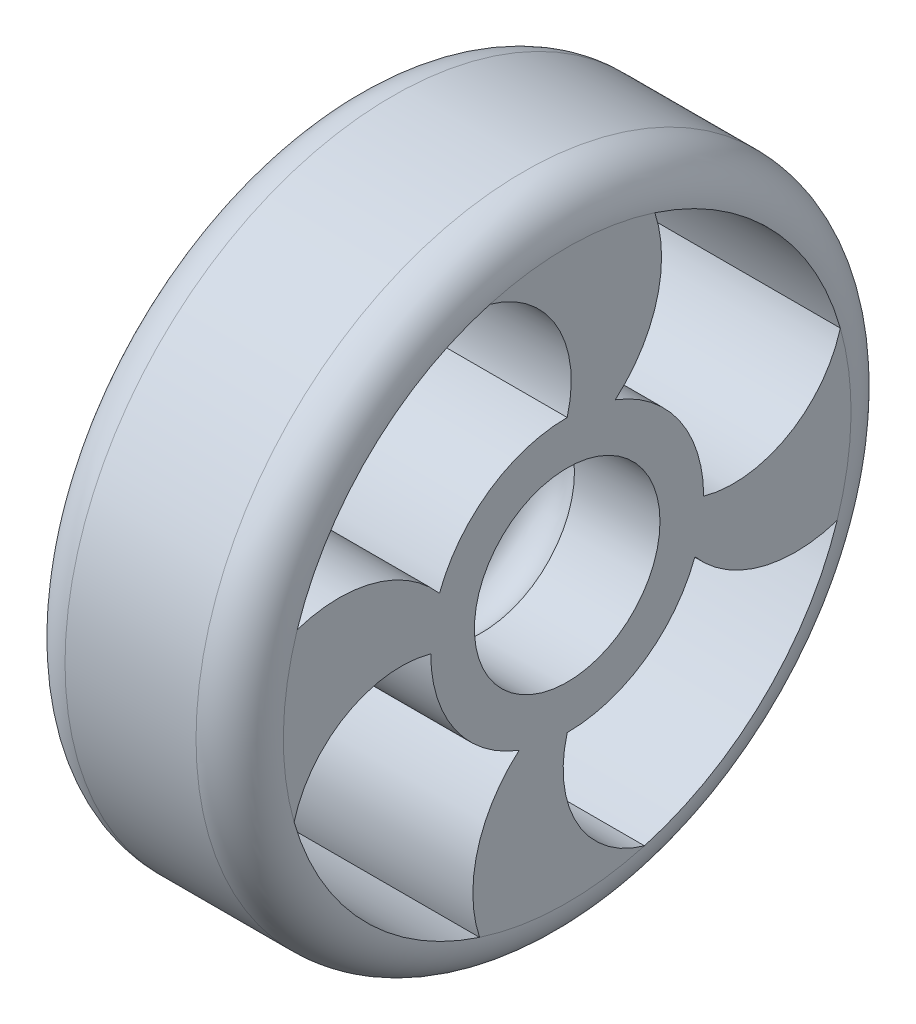
ISO-10303-21;
HEADER;
FILE_DESCRIPTION(('STEP AP214'),'2;1');
FILE_NAME('part.step','',(''),(''),'','','');
FILE_SCHEMA(('AUTOMOTIVE_DESIGN { 1 0 10303 214 1 1 1 1 }'));
ENDSEC;
DATA;
#1=APPLICATION_CONTEXT('core data for automotive mechanical design processes');
#2=APPLICATION_PROTOCOL_DEFINITION('international standard','automotive_design',2000,#1);
#3=PRODUCT_CONTEXT('',#1,'mechanical');
#4=PRODUCT('Part','Part','',(#3));
#5=PRODUCT_RELATED_PRODUCT_CATEGORY('part','',(#4));
#6=PRODUCT_DEFINITION_FORMATION('','',#4);
#7=PRODUCT_DEFINITION_CONTEXT('part definition',#1,'design');
#8=PRODUCT_DEFINITION('design','',#6,#7);
#9=PRODUCT_DEFINITION_SHAPE('','',#8);
#10=(LENGTH_UNIT() NAMED_UNIT(*) SI_UNIT(.MILLI.,.METRE.));
#11=(NAMED_UNIT(*) PLANE_ANGLE_UNIT() SI_UNIT($,.RADIAN.));
#12=(NAMED_UNIT(*) SI_UNIT($,.STERADIAN.) SOLID_ANGLE_UNIT());
#13=UNCERTAINTY_MEASURE_WITH_UNIT(LENGTH_MEASURE(1.E-05),#10,'distance_accuracy_value','');
#14=(GEOMETRIC_REPRESENTATION_CONTEXT(3) GLOBAL_UNCERTAINTY_ASSIGNED_CONTEXT((#13)) GLOBAL_UNIT_ASSIGNED_CONTEXT((#10,
#11,#12)) REPRESENTATION_CONTEXT('',''));
#15=CARTESIAN_POINT('',(0.,0.,0.));
#16=DIRECTION('',(0.,0.,1.));
#17=DIRECTION('',(1.,0.,0.));
#18=AXIS2_PLACEMENT_3D('',#15,#16,#17);
#19=CARTESIAN_POINT('',(25.4,0.,0.));
#20=DIRECTION('',(-1.,0.,0.));
#21=DIRECTION('',(0.,0.,1.));
#22=AXIS2_PLACEMENT_3D('',#19,#20,#21);
#23=CYLINDRICAL_SURFACE('',#22,10.795);
#24=CARTESIAN_POINT('',(0.,0.,0.));
#25=DIRECTION('',(1.,0.,0.));
#26=DIRECTION('',(0.,0.,-1.));
#27=AXIS2_PLACEMENT_3D('',#24,#25,#26);
#28=CIRCLE('',#27,10.795);
#29=CARTESIAN_POINT('',(0.,0.,-10.795));
#30=VERTEX_POINT('',#29);
#31=EDGE_CURVE('E245',#30,#30,#28,.T.);
#32=ORIENTED_EDGE('',*,*,#31,.F.);
#33=EDGE_LOOP('',(#32));
#34=FACE_BOUND('',#33,.T.);
#35=CARTESIAN_POINT('',(9.95036934298441,0.,0.));
#36=DIRECTION('',(1.,0.,0.));
#37=DIRECTION('',(0.,0.,-1.));
#38=AXIS2_PLACEMENT_3D('',#35,#36,#37);
#39=CIRCLE('',#38,10.795);
#40=CARTESIAN_POINT('',(9.95036934298441,0.,-10.795));
#41=VERTEX_POINT('',#40);
#42=CARTESIAN_POINT('',(9.95036934298441,10.795,0.));
#43=VERTEX_POINT('',#42);
#44=EDGE_CURVE('E169',#41,#43,#39,.T.);
#45=ORIENTED_EDGE('',*,*,#44,.T.);
#46=CARTESIAN_POINT('',(9.95036934298441,0.,0.));
#47=DIRECTION('',(1.,0.,0.));
#48=DIRECTION('',(0.,0.,-1.));
#49=AXIS2_PLACEMENT_3D('',#46,#47,#48);
#50=CIRCLE('',#49,10.795);
#51=EDGE_CURVE('E165',#43,#41,#50,.T.);
#52=ORIENTED_EDGE('',*,*,#51,.T.);
#53=EDGE_LOOP('',(#45,#52));
#54=FACE_BOUND('',#53,.T.);
#55=ADVANCED_FACE('F34',(#34,#54),#23,.F.);
#56=CARTESIAN_POINT('',(25.4,0.,0.));
#57=DIRECTION('',(1.,0.,0.));
#58=DIRECTION('',(0.,0.,-1.));
#59=AXIS2_PLACEMENT_3D('',#56,#57,#58);
#60=CIRCLE('',#59,10.795);
#61=CARTESIAN_POINT('',(25.4,0.,-10.795));
#62=VERTEX_POINT('',#61);
#63=EDGE_CURVE('E280',#62,#62,#60,.T.);
#64=ORIENTED_EDGE('',*,*,#63,.T.);
#65=EDGE_LOOP('',(#64));
#66=FACE_BOUND('',#65,.T.);
#67=CARTESIAN_POINT('',(15.4496306570156,0.,0.));
#68=DIRECTION('',(-1.,0.,0.));
#69=DIRECTION('',(0.,0.,1.));
#70=AXIS2_PLACEMENT_3D('',#67,#68,#69);
#71=CIRCLE('',#70,10.795);
#72=CARTESIAN_POINT('',(15.4496306570156,10.795,0.));
#73=VERTEX_POINT('',#72);
#74=CARTESIAN_POINT('',(15.4496306570156,0.,-10.795));
#75=VERTEX_POINT('',#74);
#76=EDGE_CURVE('E155',#73,#75,#71,.T.);
#77=ORIENTED_EDGE('',*,*,#76,.T.);
#78=CARTESIAN_POINT('',(15.4496306570156,0.,0.));
#79=DIRECTION('',(-1.,0.,0.));
#80=DIRECTION('',(0.,0.,1.));
#81=AXIS2_PLACEMENT_3D('',#78,#79,#80);
#82=CIRCLE('',#81,10.795);
#83=EDGE_CURVE('E159',#75,#73,#82,.T.);
#84=ORIENTED_EDGE('',*,*,#83,.T.);
#85=EDGE_LOOP('',(#77,#84));
#86=FACE_BOUND('',#85,.T.);
#87=ADVANCED_FACE('F168',(#66,#86),#23,.F.);
#88=CARTESIAN_POINT('',(25.4,0.,0.));
#89=DIRECTION('',(-1.,0.,0.));
#90=DIRECTION('',(0.,0.,1.));
#91=AXIS2_PLACEMENT_3D('',#88,#89,#90);
#92=CYLINDRICAL_SURFACE('',#91,15.875);
#93=DIRECTION('',(-1.,0.,0.));
#94=VECTOR('',#93,1.);
#95=CARTESIAN_POINT('',(25.4,0.,15.875));
#96=LINE('',#95,#94);
#97=CARTESIAN_POINT('',(25.4,0.,15.875));
#98=VERTEX_POINT('',#97);
#99=CARTESIAN_POINT('',(0.,0.,15.875));
#100=VERTEX_POINT('',#99);
#101=EDGE_CURVE('E277',#98,#100,#96,.T.);
#102=ORIENTED_EDGE('',*,*,#101,.T.);
#103=CARTESIAN_POINT('',(0.,0.,0.));
#104=DIRECTION('',(1.,0.,0.));
#105=DIRECTION('',(0.,0.,-1.));
#106=AXIS2_PLACEMENT_3D('',#103,#104,#105);
#107=CIRCLE('',#106,15.875);
#108=CARTESIAN_POINT('',(0.,-14.8592954657367,5.58721426669291));
#109=VERTEX_POINT('',#108);
#110=EDGE_CURVE('E294',#100,#109,#107,.T.);
#111=ORIENTED_EDGE('',*,*,#110,.T.);
#112=DIRECTION('',(-1.,0.,0.));
#113=VECTOR('',#112,1.);
#114=CARTESIAN_POINT('',(25.4,-14.8592954657367,5.5872142666929));
#115=LINE('',#114,#113);
#116=CARTESIAN_POINT('',(25.4,-14.8592954657367,5.58721426669291));
#117=VERTEX_POINT('',#116);
#118=EDGE_CURVE('E249',#117,#109,#115,.T.);
#119=ORIENTED_EDGE('',*,*,#118,.F.);
#120=CARTESIAN_POINT('',(25.4,0.,0.));
#121=DIRECTION('',(1.,0.,0.));
#122=DIRECTION('',(0.,0.,-1.));
#123=AXIS2_PLACEMENT_3D('',#120,#121,#122);
#124=CIRCLE('',#123,15.875);
#125=EDGE_CURVE('E293',#98,#117,#124,.T.);
#126=ORIENTED_EDGE('',*,*,#125,.F.);
#127=EDGE_LOOP('',(#102,#111,#119,#126));
#128=FACE_BOUND('',#127,.T.);
#129=ADVANCED_FACE('F298',(#128),#92,.T.);
#130=DIRECTION('',(-1.,0.,0.));
#131=VECTOR('',#130,1.);
#132=CARTESIAN_POINT('',(25.4,-15.875,0.));
#133=LINE('',#132,#131);
#134=CARTESIAN_POINT('',(25.4,-15.875,0.));
#135=VERTEX_POINT('',#134);
#136=CARTESIAN_POINT('',(0.,-15.875,0.));
#137=VERTEX_POINT('',#136);
#138=EDGE_CURVE('E252',#135,#137,#133,.T.);
#139=ORIENTED_EDGE('',*,*,#138,.T.);
#140=CARTESIAN_POINT('',(0.,-5.58721426669286,-14.8592954657367));
#141=VERTEX_POINT('',#140);
#142=EDGE_CURVE('E283',#137,#141,#107,.T.);
#143=ORIENTED_EDGE('',*,*,#142,.T.);
#144=DIRECTION('',(-1.,0.,0.));
#145=VECTOR('',#144,1.);
#146=CARTESIAN_POINT('',(25.4,-5.58721426669285,-14.8592954657367));
#147=LINE('',#146,#145);
#148=CARTESIAN_POINT('',(25.4,-5.58721426669286,-14.8592954657367));
#149=VERTEX_POINT('',#148);
#150=EDGE_CURVE('E223',#149,#141,#147,.T.);
#151=ORIENTED_EDGE('',*,*,#150,.F.);
#152=EDGE_CURVE('E288',#135,#149,#124,.T.);
#153=ORIENTED_EDGE('',*,*,#152,.F.);
#154=EDGE_LOOP('',(#139,#143,#151,#153));
#155=FACE_BOUND('',#154,.T.);
#156=ADVANCED_FACE('F400',(#155),#92,.T.);
#157=DIRECTION('',(-1.,0.,0.));
#158=VECTOR('',#157,1.);
#159=CARTESIAN_POINT('',(25.4,1.12757025938492E-13,-15.875));
#160=LINE('',#159,#158);
#161=CARTESIAN_POINT('',(25.4,1.12757025938492E-13,-15.875));
#162=VERTEX_POINT('',#161);
#163=CARTESIAN_POINT('',(0.,0.,-15.875));
#164=VERTEX_POINT('',#163);
#165=EDGE_CURVE('E256',#162,#164,#160,.T.);
#166=ORIENTED_EDGE('',*,*,#165,.T.);
#167=CARTESIAN_POINT('',(0.,14.8592954657367,-5.58721426669281));
#168=VERTEX_POINT('',#167);
#169=EDGE_CURVE('E289',#164,#168,#107,.T.);
#170=ORIENTED_EDGE('',*,*,#169,.T.);
#171=DIRECTION('',(-1.,0.,0.));
#172=VECTOR('',#171,1.);
#173=CARTESIAN_POINT('',(25.4,14.8592954657367,-5.58721426669281));
#174=LINE('',#173,#172);
#175=CARTESIAN_POINT('',(25.4,14.8592954657367,-5.58721426669281));
#176=VERTEX_POINT('',#175);
#177=EDGE_CURVE('E263',#176,#168,#174,.T.);
#178=ORIENTED_EDGE('',*,*,#177,.F.);
#179=EDGE_CURVE('E160',#162,#176,#124,.T.);
#180=ORIENTED_EDGE('',*,*,#179,.F.);
#181=EDGE_LOOP('',(#166,#170,#178,#180));
#182=FACE_BOUND('',#181,.T.);
#183=ADVANCED_FACE('F580',(#182),#92,.T.);
#184=DIRECTION('',(-1.,0.,0.));
#185=VECTOR('',#184,1.);
#186=CARTESIAN_POINT('',(25.4,15.875,1.6826817716975E-13));
#187=LINE('',#186,#185);
#188=CARTESIAN_POINT('',(25.4,15.875,1.6826817716975E-13));
#189=VERTEX_POINT('',#188);
#190=CARTESIAN_POINT('',(0.,15.875,1.66645094246512E-13));
#191=VERTEX_POINT('',#190);
#192=EDGE_CURVE('E266',#189,#191,#187,.T.);
#193=ORIENTED_EDGE('',*,*,#192,.T.);
#194=CARTESIAN_POINT('',(0.,5.58721426669296,14.8592954657367));
#195=VERTEX_POINT('',#194);
#196=EDGE_CURVE('E290',#191,#195,#107,.T.);
#197=ORIENTED_EDGE('',*,*,#196,.T.);
#198=DIRECTION('',(-1.,0.,0.));
#199=VECTOR('',#198,1.);
#200=CARTESIAN_POINT('',(25.4,5.58721426669296,14.8592954657367));
#201=LINE('',#200,#199);
#202=CARTESIAN_POINT('',(25.4,5.58721426669296,14.8592954657367));
#203=VERTEX_POINT('',#202);
#204=EDGE_CURVE('E274',#203,#195,#201,.T.);
#205=ORIENTED_EDGE('',*,*,#204,.F.);
#206=EDGE_CURVE('E287',#189,#203,#124,.T.);
#207=ORIENTED_EDGE('',*,*,#206,.F.);
#208=EDGE_LOOP('',(#193,#197,#205,#207));
#209=FACE_BOUND('',#208,.T.);
#210=ADVANCED_FACE('F373',(#209),#92,.T.);
#211=CARTESIAN_POINT('',(25.4,0.,0.));
#212=DIRECTION('',(1.,0.,0.));
#213=DIRECTION('',(0.,0.,-1.));
#214=AXIS2_PLACEMENT_3D('',#211,#212,#213);
#215=PLANE('',#214);
#216=CARTESIAN_POINT('',(25.4,-26.5615105564731,-4.42340725616082));
#217=DIRECTION('',(1.,0.,0.));
#218=DIRECTION('',(0.,0.,-1.));
#219=AXIS2_PLACEMENT_3D('',#216,#217,#218);
#220=CIRCLE('',#219,15.3998175737143);
#221=CARTESIAN_POINT('',(25.4,-31.4069682527934,10.1942505937429));
#222=VERTEX_POINT('',#221);
#223=EDGE_CURVE('E309',#117,#222,#220,.T.);
#224=ORIENTED_EDGE('',*,*,#223,.T.);
#225=CARTESIAN_POINT('',(25.4,0.,0.));
#226=DIRECTION('',(1.,0.,0.));
#227=DIRECTION('',(0.,0.,-1.));
#228=AXIS2_PLACEMENT_3D('',#225,#226,#227);
#229=CIRCLE('',#228,33.02);
#230=CARTESIAN_POINT('',(25.4,-31.7723162186838,-8.99112462931971));
#231=VERTEX_POINT('',#230);
#232=EDGE_CURVE('E187',#222,#231,#229,.T.);
#233=ORIENTED_EDGE('',*,*,#232,.T.);
#234=CARTESIAN_POINT('',(25.4,-19.3280957946821,-12.4442204240018));
#235=DIRECTION('',(-1.,0.,0.));
#236=DIRECTION('',(0.,0.,-1.));
#237=AXIS2_PLACEMENT_3D('',#234,#235,#236);
#238=CIRCLE('',#237,12.9144296245864);
#239=EDGE_CURVE('E324',#231,#135,#238,.T.);
#240=ORIENTED_EDGE('',*,*,#239,.T.);
#241=ORIENTED_EDGE('',*,*,#152,.T.);
#242=CARTESIAN_POINT('',(25.4,4.42340725616091,-26.5615105564731));
#243=DIRECTION('',(1.,0.,0.));
#244=DIRECTION('',(0.,0.,-1.));
#245=AXIS2_PLACEMENT_3D('',#242,#243,#244);
#246=CIRCLE('',#245,15.3998175737143);
#247=CARTESIAN_POINT('',(25.4,-10.1942505937427,-31.4069682527935));
#248=VERTEX_POINT('',#247);
#249=EDGE_CURVE('E393',#149,#248,#246,.T.);
#250=ORIENTED_EDGE('',*,*,#249,.T.);
#251=CARTESIAN_POINT('',(25.4,0.,0.));
#252=DIRECTION('',(1.,0.,0.));
#253=DIRECTION('',(0.,0.,-1.));
#254=AXIS2_PLACEMENT_3D('',#251,#252,#253);
#255=CIRCLE('',#254,33.02);
#256=CARTESIAN_POINT('',(25.4,8.9911246293198,-31.7723162186838));
#257=VERTEX_POINT('',#256);
#258=EDGE_CURVE('E185',#248,#257,#255,.T.);
#259=ORIENTED_EDGE('',*,*,#258,.T.);
#260=CARTESIAN_POINT('',(25.4,12.4442204240019,-19.3280957946821));
#261=DIRECTION('',(-1.,0.,0.));
#262=DIRECTION('',(0.,0.,-1.));
#263=AXIS2_PLACEMENT_3D('',#260,#261,#262);
#264=CIRCLE('',#263,12.9144296245864);
#265=EDGE_CURVE('E351',#257,#162,#264,.T.);
#266=ORIENTED_EDGE('',*,*,#265,.T.);
#267=ORIENTED_EDGE('',*,*,#179,.T.);
#268=CARTESIAN_POINT('',(25.4,26.561510556473,4.42340725616101));
#269=DIRECTION('',(1.,0.,0.));
#270=DIRECTION('',(0.,0.,-1.));
#271=AXIS2_PLACEMENT_3D('',#268,#269,#270);
#272=CIRCLE('',#271,15.3998175737143);
#273=CARTESIAN_POINT('',(25.4,31.4069682527935,-10.1942505937426));
#274=VERTEX_POINT('',#273);
#275=EDGE_CURVE('E387',#176,#274,#272,.T.);
#276=ORIENTED_EDGE('',*,*,#275,.T.);
#277=CARTESIAN_POINT('',(25.4,0.,0.));
#278=DIRECTION('',(1.,0.,0.));
#279=DIRECTION('',(0.,0.,-1.));
#280=AXIS2_PLACEMENT_3D('',#277,#278,#279);
#281=CIRCLE('',#280,33.02);
#282=CARTESIAN_POINT('',(25.4,31.7723162186838,8.99112462931992));
#283=VERTEX_POINT('',#282);
#284=EDGE_CURVE('E183',#274,#283,#281,.T.);
#285=ORIENTED_EDGE('',*,*,#284,.T.);
#286=CARTESIAN_POINT('',(25.4,19.328095794682,12.4442204240019));
#287=DIRECTION('',(-1.,0.,0.));
#288=DIRECTION('',(0.,0.,-1.));
#289=AXIS2_PLACEMENT_3D('',#286,#287,#288);
#290=CIRCLE('',#289,12.9144296245863);
#291=EDGE_CURVE('E365',#283,#189,#290,.T.);
#292=ORIENTED_EDGE('',*,*,#291,.T.);
#293=ORIENTED_EDGE('',*,*,#206,.T.);
#294=CARTESIAN_POINT('',(25.4,-4.42340725616073,26.5615105564731));
#295=DIRECTION('',(1.,0.,0.));
#296=DIRECTION('',(0.,0.,-1.));
#297=AXIS2_PLACEMENT_3D('',#294,#295,#296);
#298=CIRCLE('',#297,15.3998175737143);
#299=CARTESIAN_POINT('',(25.4,10.194250593743,31.4069682527934));
#300=VERTEX_POINT('',#299);
#301=EDGE_CURVE('E379',#203,#300,#298,.T.);
#302=ORIENTED_EDGE('',*,*,#301,.T.);
#303=CARTESIAN_POINT('',(25.4,0.,0.));
#304=DIRECTION('',(1.,0.,0.));
#305=DIRECTION('',(0.,0.,-1.));
#306=AXIS2_PLACEMENT_3D('',#303,#304,#305);
#307=CIRCLE('',#306,33.02);
#308=CARTESIAN_POINT('',(25.4,-8.99112462931958,31.7723162186839));
#309=VERTEX_POINT('',#308);
#310=EDGE_CURVE('E181',#300,#309,#307,.T.);
#311=ORIENTED_EDGE('',*,*,#310,.T.);
#312=CARTESIAN_POINT('',(25.4,-12.4442204240017,19.3280957946821));
#313=DIRECTION('',(-1.,0.,0.));
#314=DIRECTION('',(0.,0.,-1.));
#315=AXIS2_PLACEMENT_3D('',#312,#313,#314);
#316=CIRCLE('',#315,12.9144296245864);
#317=EDGE_CURVE('E242',#309,#98,#316,.T.);
#318=ORIENTED_EDGE('',*,*,#317,.T.);
#319=ORIENTED_EDGE('',*,*,#125,.T.);
#320=EDGE_LOOP('',(#224,#233,#240,#241,#250,#259,#266,#267,#276,#285,#292,#293,#302,#311,#318,#319));
#321=FACE_BOUND('',#320,.T.);
#322=ORIENTED_EDGE('',*,*,#63,.F.);
#323=EDGE_LOOP('',(#322));
#324=FACE_BOUND('',#323,.T.);
#325=ADVANCED_FACE('F320',(#321,#324),#215,.T.);
#326=CARTESIAN_POINT('',(0.,0.,0.));
#327=DIRECTION('',(1.,0.,0.));
#328=DIRECTION('',(0.,0.,-1.));
#329=AXIS2_PLACEMENT_3D('',#326,#327,#328);
#330=PLANE('',#329);
#331=CARTESIAN_POINT('',(0.,19.328095794682,12.4442204240019));
#332=DIRECTION('',(-1.,0.,0.));
#333=DIRECTION('',(0.,0.,-1.));
#334=AXIS2_PLACEMENT_3D('',#331,#332,#333);
#335=CIRCLE('',#334,12.9144296245863);
#336=CARTESIAN_POINT('',(0.,31.7723162186838,8.99112462931992));
#337=VERTEX_POINT('',#336);
#338=EDGE_CURVE('E337',#337,#191,#335,.T.);
#339=ORIENTED_EDGE('',*,*,#338,.F.);
#340=CARTESIAN_POINT('',(0.,0.,0.));
#341=DIRECTION('',(1.,0.,0.));
#342=DIRECTION('',(0.,0.,-1.));
#343=AXIS2_PLACEMENT_3D('',#340,#341,#342);
#344=CIRCLE('',#343,33.02);
#345=CARTESIAN_POINT('',(0.,31.4069682527935,-10.1942505937426));
#346=VERTEX_POINT('',#345);
#347=EDGE_CURVE('E11',#337,#346,#344,.F.);
#348=ORIENTED_EDGE('',*,*,#347,.T.);
#349=CARTESIAN_POINT('',(0.,26.561510556473,4.42340725616101));
#350=DIRECTION('',(1.,0.,0.));
#351=DIRECTION('',(0.,0.,-1.));
#352=AXIS2_PLACEMENT_3D('',#349,#350,#351);
#353=CIRCLE('',#352,15.3998175737143);
#354=EDGE_CURVE('E340',#168,#346,#353,.T.);
#355=ORIENTED_EDGE('',*,*,#354,.F.);
#356=ORIENTED_EDGE('',*,*,#169,.F.);
#357=CARTESIAN_POINT('',(0.,12.4442204240019,-19.3280957946821));
#358=DIRECTION('',(-1.,0.,0.));
#359=DIRECTION('',(0.,0.,-1.));
#360=AXIS2_PLACEMENT_3D('',#357,#358,#359);
#361=CIRCLE('',#360,12.9144296245864);
#362=CARTESIAN_POINT('',(0.,8.9911246293198,-31.7723162186838));
#363=VERTEX_POINT('',#362);
#364=EDGE_CURVE('E205',#363,#164,#361,.T.);
#365=ORIENTED_EDGE('',*,*,#364,.F.);
#366=CARTESIAN_POINT('',(0.,0.,0.));
#367=DIRECTION('',(1.,0.,0.));
#368=DIRECTION('',(0.,0.,-1.));
#369=AXIS2_PLACEMENT_3D('',#366,#367,#368);
#370=CIRCLE('',#369,33.02);
#371=CARTESIAN_POINT('',(0.,-10.1942505937427,-31.4069682527935));
#372=VERTEX_POINT('',#371);
#373=EDGE_CURVE('E42',#363,#372,#370,.F.);
#374=ORIENTED_EDGE('',*,*,#373,.T.);
#375=CARTESIAN_POINT('',(0.,4.42340725616091,-26.5615105564731));
#376=DIRECTION('',(1.,0.,0.));
#377=DIRECTION('',(0.,0.,-1.));
#378=AXIS2_PLACEMENT_3D('',#375,#376,#377);
#379=CIRCLE('',#378,15.3998175737143);
#380=EDGE_CURVE('E202',#141,#372,#379,.T.);
#381=ORIENTED_EDGE('',*,*,#380,.F.);
#382=ORIENTED_EDGE('',*,*,#142,.F.);
#383=CARTESIAN_POINT('',(0.,-19.3280957946821,-12.4442204240018));
#384=DIRECTION('',(-1.,0.,0.));
#385=DIRECTION('',(0.,0.,-1.));
#386=AXIS2_PLACEMENT_3D('',#383,#384,#385);
#387=CIRCLE('',#386,12.9144296245864);
#388=CARTESIAN_POINT('',(0.,-31.7723162186838,-8.99112462931971));
#389=VERTEX_POINT('',#388);
#390=EDGE_CURVE('E230',#389,#137,#387,.T.);
#391=ORIENTED_EDGE('',*,*,#390,.F.);
#392=CARTESIAN_POINT('',(0.,0.,0.));
#393=DIRECTION('',(1.,0.,0.));
#394=DIRECTION('',(0.,0.,-1.));
#395=AXIS2_PLACEMENT_3D('',#392,#393,#394);
#396=CIRCLE('',#395,33.02);
#397=CARTESIAN_POINT('',(0.,-31.4069682527934,10.1942505937429));
#398=VERTEX_POINT('',#397);
#399=EDGE_CURVE('E191',#389,#398,#396,.F.);
#400=ORIENTED_EDGE('',*,*,#399,.T.);
#401=CARTESIAN_POINT('',(0.,-26.5615105564731,-4.42340725616082));
#402=DIRECTION('',(1.,0.,0.));
#403=DIRECTION('',(0.,0.,-1.));
#404=AXIS2_PLACEMENT_3D('',#401,#402,#403);
#405=CIRCLE('',#404,15.3998175737143);
#406=EDGE_CURVE('E233',#109,#398,#405,.T.);
#407=ORIENTED_EDGE('',*,*,#406,.F.);
#408=ORIENTED_EDGE('',*,*,#110,.F.);
#409=CARTESIAN_POINT('',(0.,-12.4442204240017,19.3280957946821));
#410=DIRECTION('',(-1.,0.,0.));
#411=DIRECTION('',(0.,0.,-1.));
#412=AXIS2_PLACEMENT_3D('',#409,#410,#411);
#413=CIRCLE('',#412,12.9144296245864);
#414=CARTESIAN_POINT('',(0.,-8.99112462931958,31.7723162186839));
#415=VERTEX_POINT('',#414);
#416=EDGE_CURVE('E329',#415,#100,#413,.T.);
#417=ORIENTED_EDGE('',*,*,#416,.F.);
#418=CARTESIAN_POINT('',(0.,0.,0.));
#419=DIRECTION('',(1.,0.,0.));
#420=DIRECTION('',(0.,0.,-1.));
#421=AXIS2_PLACEMENT_3D('',#418,#419,#420);
#422=CIRCLE('',#421,33.02);
#423=CARTESIAN_POINT('',(0.,10.194250593743,31.4069682527934));
#424=VERTEX_POINT('',#423);
#425=EDGE_CURVE('E189',#415,#424,#422,.F.);
#426=ORIENTED_EDGE('',*,*,#425,.T.);
#427=CARTESIAN_POINT('',(0.,-4.42340725616073,26.5615105564731));
#428=DIRECTION('',(1.,0.,0.));
#429=DIRECTION('',(0.,0.,-1.));
#430=AXIS2_PLACEMENT_3D('',#427,#428,#429);
#431=CIRCLE('',#430,15.3998175737143);
#432=EDGE_CURVE('E331',#195,#424,#431,.T.);
#433=ORIENTED_EDGE('',*,*,#432,.F.);
#434=ORIENTED_EDGE('',*,*,#196,.F.);
#435=EDGE_LOOP('',(#339,#348,#355,#356,#365,#374,#381,#382,#391,#400,#407,#408,#417,#426,#433,#434));
#436=FACE_BOUND('',#435,.T.);
#437=ORIENTED_EDGE('',*,*,#31,.T.);
#438=EDGE_LOOP('',(#437));
#439=FACE_BOUND('',#438,.T.);
#440=ADVANCED_FACE('F198',(#436,#439),#330,.F.);
#441=CARTESIAN_POINT('',(25.4,0.,0.));
#442=DIRECTION('',(-1.,0.,0.));
#443=DIRECTION('',(0.,0.,1.));
#444=AXIS2_PLACEMENT_3D('',#441,#442,#443);
#445=CYLINDRICAL_SURFACE('',#444,38.1);
#446=CARTESIAN_POINT('',(20.32,0.,0.));
#447=DIRECTION('',(1.,0.,0.));
#448=DIRECTION('',(0.,0.,-1.));
#449=AXIS2_PLACEMENT_3D('',#446,#447,#448);
#450=CIRCLE('',#449,38.1);
#451=CARTESIAN_POINT('',(20.32,0.,38.1));
#452=VERTEX_POINT('',#451);
#453=EDGE_CURVE('E178',#452,#452,#450,.F.);
#454=CARTESIAN_POINT('',(5.08,0.,0.));
#455=DIRECTION('',(1.,0.,0.));
#456=DIRECTION('',(0.,0.,-1.));
#457=AXIS2_PLACEMENT_3D('',#454,#455,#456);
#458=CIRCLE('',#457,38.1);
#459=CARTESIAN_POINT('',(5.08,0.,38.1));
#460=VERTEX_POINT('',#459);
#461=EDGE_CURVE('E175',#460,#460,#458,.T.);
#462=CARTESIAN_POINT('',(20.32,0.,38.1));
#463=CARTESIAN_POINT('',(20.16125,0.,38.1));
#464=CARTESIAN_POINT('',(20.0025,0.,38.1));
#465=CARTESIAN_POINT('',(19.685,0.,38.1));
#466=CARTESIAN_POINT('',(19.52625,0.,38.1));
#467=CARTESIAN_POINT('',(19.20875,0.,38.1));
#468=CARTESIAN_POINT('',(19.05,0.,38.1));
#469=CARTESIAN_POINT('',(18.7325,0.,38.1));
#470=CARTESIAN_POINT('',(18.57375,0.,38.1));
#471=CARTESIAN_POINT('',(18.25625,0.,38.1));
#472=CARTESIAN_POINT('',(18.0975,0.,38.1));
#473=CARTESIAN_POINT('',(17.78,0.,38.1));
#474=CARTESIAN_POINT('',(17.62125,0.,38.1));
#475=CARTESIAN_POINT('',(17.30375,0.,38.1));
#476=CARTESIAN_POINT('',(17.145,0.,38.1));
#477=CARTESIAN_POINT('',(16.8275,0.,38.1));
#478=CARTESIAN_POINT('',(16.66875,0.,38.1));
#479=CARTESIAN_POINT('',(16.35125,0.,38.1));
#480=CARTESIAN_POINT('',(16.1925,0.,38.1));
#481=CARTESIAN_POINT('',(15.875,0.,38.1));
#482=CARTESIAN_POINT('',(15.71625,0.,38.1));
#483=CARTESIAN_POINT('',(15.39875,0.,38.1));
#484=CARTESIAN_POINT('',(15.24,0.,38.1));
#485=CARTESIAN_POINT('',(14.9225,0.,38.1));
#486=CARTESIAN_POINT('',(14.76375,0.,38.1));
#487=CARTESIAN_POINT('',(14.44625,0.,38.1));
#488=CARTESIAN_POINT('',(14.2875,0.,38.1));
#489=CARTESIAN_POINT('',(13.97,0.,38.1));
#490=CARTESIAN_POINT('',(13.81125,0.,38.1));
#491=CARTESIAN_POINT('',(13.49375,0.,38.1));
#492=CARTESIAN_POINT('',(13.335,0.,38.1));
#493=CARTESIAN_POINT('',(13.0175,0.,38.1));
#494=CARTESIAN_POINT('',(12.85875,0.,38.1));
#495=CARTESIAN_POINT('',(12.54125,0.,38.1));
#496=CARTESIAN_POINT('',(12.3825,0.,38.1));
#497=CARTESIAN_POINT('',(12.065,0.,38.1));
#498=CARTESIAN_POINT('',(11.90625,0.,38.1));
#499=CARTESIAN_POINT('',(11.58875,0.,38.1));
#500=CARTESIAN_POINT('',(11.43,0.,38.1));
#501=CARTESIAN_POINT('',(11.1125,0.,38.1));
#502=CARTESIAN_POINT('',(10.95375,0.,38.1));
#503=CARTESIAN_POINT('',(10.63625,0.,38.1));
#504=CARTESIAN_POINT('',(10.4775,0.,38.1));
#505=CARTESIAN_POINT('',(10.16,0.,38.1));
#506=CARTESIAN_POINT('',(10.00125,0.,38.1));
#507=CARTESIAN_POINT('',(9.68375,0.,38.1));
#508=CARTESIAN_POINT('',(9.525,0.,38.1));
#509=CARTESIAN_POINT('',(9.2075,0.,38.1));
#510=CARTESIAN_POINT('',(9.04875,0.,38.1));
#511=CARTESIAN_POINT('',(8.73125,0.,38.1));
#512=CARTESIAN_POINT('',(8.5725,0.,38.1));
#513=CARTESIAN_POINT('',(8.255,0.,38.1));
#514=CARTESIAN_POINT('',(8.09625,0.,38.1));
#515=CARTESIAN_POINT('',(7.77875,0.,38.1));
#516=CARTESIAN_POINT('',(7.62,0.,38.1));
#517=CARTESIAN_POINT('',(7.3025,0.,38.1));
#518=CARTESIAN_POINT('',(7.14375,0.,38.1));
#519=CARTESIAN_POINT('',(6.82625,0.,38.1));
#520=CARTESIAN_POINT('',(6.6675,0.,38.1));
#521=CARTESIAN_POINT('',(6.35,0.,38.1));
#522=CARTESIAN_POINT('',(6.19125,0.,38.1));
#523=CARTESIAN_POINT('',(5.87375,0.,38.1));
#524=CARTESIAN_POINT('',(5.715,0.,38.1));
#525=CARTESIAN_POINT('',(5.3975,0.,38.1));
#526=CARTESIAN_POINT('',(5.23875,0.,38.1));
#527=CARTESIAN_POINT('',(5.08,0.,38.1));
#528=B_SPLINE_CURVE_WITH_KNOTS('',3,(#462,#463,#464,#465,#466,#467,#468,#469,#470,#471,#472,
#473,#474,#475,#476,#477,#478,#479,#480,#481,#482,#483,#484,#485,#486,#487,#488,#489,#490,#491,
#492,#493,#494,#495,#496,#497,#498,#499,#500,#501,#502,#503,#504,#505,#506,#507,#508,#509,#510,
#511,#512,#513,#514,#515,#516,#517,#518,#519,#520,#521,#522,#523,#524,#525,#526,#527),
.UNSPECIFIED.,.F.,.F.,(4,2,2,2,2,2,2,2,2,2,2,2,2,2,2,2,2,2,2,2,2,2,2,2,2,2,2,2,2,2,2,2,4),(0.,
0.476250000000001,0.952500000000002,1.42875,1.905,2.38125,2.8575,3.33375,3.81,4.28625,4.7625,
5.23875,5.715,6.19125,6.6675,7.14375,7.62,8.09625,8.5725,9.04875,9.525,10.00125,10.4775,
10.95375,11.43,11.90625,12.3825,12.85875,13.335,13.81125,14.2875,14.76375,15.24),.UNSPECIFIED.);
#529=EDGE_CURVE('BSEAM422',#452,#460,#528,.T.);
#530=ORIENTED_EDGE('',*,*,#453,.T.);
#531=ORIENTED_EDGE('',*,*,#461,.T.);
#532=ORIENTED_EDGE('',*,*,#529,.T.);
#533=ORIENTED_EDGE('',*,*,#529,.F.);
#534=EDGE_LOOP('',(#530,#532,#531,#533));
#535=FACE_BOUND('',#534,.T.);
#536=ADVANCED_FACE('F422',(#535),#445,.T.);
#537=CARTESIAN_POINT('',(25.4,-12.4442204240017,19.3280957946821));
#538=DIRECTION('',(-1.,0.,0.));
#539=DIRECTION('',(0.,0.,1.));
#540=AXIS2_PLACEMENT_3D('',#537,#538,#539);
#541=CYLINDRICAL_SURFACE('',#540,12.9144296245864);
#542=ORIENTED_EDGE('',*,*,#416,.T.);
#543=ORIENTED_EDGE('',*,*,#101,.F.);
#544=ORIENTED_EDGE('',*,*,#317,.F.);
#545=DIRECTION('',(-1.,0.,0.));
#546=VECTOR('',#545,1.);
#547=CARTESIAN_POINT('',(25.4,-8.99112462931958,31.7723162186839));
#548=LINE('',#547,#546);
#549=EDGE_CURVE('E243',#309,#415,#548,.T.);
#550=ORIENTED_EDGE('',*,*,#549,.T.);
#551=EDGE_LOOP('',(#542,#543,#544,#550));
#552=FACE_BOUND('',#551,.T.);
#553=ADVANCED_FACE('F442',(#552),#541,.F.);
#554=CARTESIAN_POINT('',(25.4,0.,0.));
#555=DIRECTION('',(-1.,0.,0.));
#556=DIRECTION('',(0.,0.,1.));
#557=AXIS2_PLACEMENT_3D('',#554,#555,#556);
#558=CYLINDRICAL_SURFACE('',#557,33.02);
#559=CARTESIAN_POINT('',(0.,0.,0.));
#560=DIRECTION('',(-1.,0.,0.));
#561=DIRECTION('',(0.,0.,1.));
#562=AXIS2_PLACEMENT_3D('',#559,#560,#561);
#563=CIRCLE('',#562,33.02);
#564=EDGE_CURVE('E239',#398,#415,#563,.T.);
#565=ORIENTED_EDGE('',*,*,#564,.T.);
#566=ORIENTED_EDGE('',*,*,#549,.F.);
#567=CARTESIAN_POINT('',(25.4,0.,0.));
#568=DIRECTION('',(-1.,0.,0.));
#569=DIRECTION('',(0.,0.,1.));
#570=AXIS2_PLACEMENT_3D('',#567,#568,#569);
#571=CIRCLE('',#570,33.02);
#572=EDGE_CURVE('E279',#222,#309,#571,.T.);
#573=ORIENTED_EDGE('',*,*,#572,.F.);
#574=DIRECTION('',(-1.,0.,0.));
#575=VECTOR('',#574,1.);
#576=CARTESIAN_POINT('',(25.4,-31.4069682527934,10.1942505937429));
#577=LINE('',#576,#575);
#578=EDGE_CURVE('E246',#222,#398,#577,.T.);
#579=ORIENTED_EDGE('',*,*,#578,.T.);
#580=EDGE_LOOP('',(#565,#566,#573,#579));
#581=FACE_BOUND('',#580,.T.);
#582=ADVANCED_FACE('F312',(#581),#558,.F.);
#583=CARTESIAN_POINT('',(25.4,-26.5615105564731,-4.42340725616082));
#584=DIRECTION('',(-1.,0.,0.));
#585=DIRECTION('',(0.,0.,1.));
#586=AXIS2_PLACEMENT_3D('',#583,#584,#585);
#587=CYLINDRICAL_SURFACE('',#586,15.3998175737143);
#588=ORIENTED_EDGE('',*,*,#406,.T.);
#589=ORIENTED_EDGE('',*,*,#578,.F.);
#590=ORIENTED_EDGE('',*,*,#223,.F.);
#591=ORIENTED_EDGE('',*,*,#118,.T.);
#592=EDGE_LOOP('',(#588,#589,#590,#591));
#593=FACE_BOUND('',#592,.T.);
#594=ADVANCED_FACE('F306',(#593),#587,.T.);
#595=CARTESIAN_POINT('',(25.4,-19.3280957946821,-12.4442204240018));
#596=DIRECTION('',(-1.,0.,0.));
#597=DIRECTION('',(0.,0.,1.));
#598=AXIS2_PLACEMENT_3D('',#595,#596,#597);
#599=CYLINDRICAL_SURFACE('',#598,12.9144296245864);
#600=ORIENTED_EDGE('',*,*,#390,.T.);
#601=ORIENTED_EDGE('',*,*,#138,.F.);
#602=ORIENTED_EDGE('',*,*,#239,.F.);
#603=DIRECTION('',(-1.,0.,0.));
#604=VECTOR('',#603,1.);
#605=CARTESIAN_POINT('',(25.4,-31.7723162186838,-8.99112462931971));
#606=LINE('',#605,#604);
#607=EDGE_CURVE('E222',#231,#389,#606,.T.);
#608=ORIENTED_EDGE('',*,*,#607,.T.);
#609=EDGE_LOOP('',(#600,#601,#602,#608));
#610=FACE_BOUND('',#609,.T.);
#611=ADVANCED_FACE('F402',(#610),#599,.F.);
#612=CARTESIAN_POINT('',(25.4,0.,0.));
#613=DIRECTION('',(-1.,0.,0.));
#614=DIRECTION('',(0.,0.,1.));
#615=AXIS2_PLACEMENT_3D('',#612,#613,#614);
#616=CYLINDRICAL_SURFACE('',#615,33.02);
#617=CARTESIAN_POINT('',(0.,0.,0.));
#618=DIRECTION('',(-1.,0.,0.));
#619=DIRECTION('',(0.,0.,1.));
#620=AXIS2_PLACEMENT_3D('',#617,#618,#619);
#621=CIRCLE('',#620,33.02);
#622=EDGE_CURVE('E215',#372,#389,#621,.T.);
#623=ORIENTED_EDGE('',*,*,#622,.T.);
#624=ORIENTED_EDGE('',*,*,#607,.F.);
#625=CARTESIAN_POINT('',(25.4,0.,0.));
#626=DIRECTION('',(-1.,0.,0.));
#627=DIRECTION('',(0.,0.,1.));
#628=AXIS2_PLACEMENT_3D('',#625,#626,#627);
#629=CIRCLE('',#628,33.02);
#630=EDGE_CURVE('E218',#248,#231,#629,.T.);
#631=ORIENTED_EDGE('',*,*,#630,.F.);
#632=DIRECTION('',(-1.,0.,0.));
#633=VECTOR('',#632,1.);
#634=CARTESIAN_POINT('',(25.4,-10.1942505937427,-31.4069682527935));
#635=LINE('',#634,#633);
#636=EDGE_CURVE('E212',#248,#372,#635,.T.);
#637=ORIENTED_EDGE('',*,*,#636,.T.);
#638=EDGE_LOOP('',(#623,#624,#631,#637));
#639=FACE_BOUND('',#638,.T.);
#640=ADVANCED_FACE('F213',(#639),#616,.F.);
#641=CARTESIAN_POINT('',(25.4,4.42340725616091,-26.5615105564731));
#642=DIRECTION('',(-1.,0.,0.));
#643=DIRECTION('',(0.,0.,1.));
#644=AXIS2_PLACEMENT_3D('',#641,#642,#643);
#645=CYLINDRICAL_SURFACE('',#644,15.3998175737143);
#646=ORIENTED_EDGE('',*,*,#380,.T.);
#647=ORIENTED_EDGE('',*,*,#636,.F.);
#648=ORIENTED_EDGE('',*,*,#249,.F.);
#649=ORIENTED_EDGE('',*,*,#150,.T.);
#650=EDGE_LOOP('',(#646,#647,#648,#649));
#651=FACE_BOUND('',#650,.T.);
#652=ADVANCED_FACE('F226',(#651),#645,.T.);
#653=CARTESIAN_POINT('',(25.4,12.4442204240019,-19.3280957946821));
#654=DIRECTION('',(-1.,0.,0.));
#655=DIRECTION('',(0.,0.,1.));
#656=AXIS2_PLACEMENT_3D('',#653,#654,#655);
#657=CYLINDRICAL_SURFACE('',#656,12.9144296245864);
#658=ORIENTED_EDGE('',*,*,#364,.T.);
#659=ORIENTED_EDGE('',*,*,#165,.F.);
#660=ORIENTED_EDGE('',*,*,#265,.F.);
#661=DIRECTION('',(-1.,0.,0.));
#662=VECTOR('',#661,1.);
#663=CARTESIAN_POINT('',(25.4,8.9911246293198,-31.7723162186838));
#664=LINE('',#663,#662);
#665=EDGE_CURVE('E258',#257,#363,#664,.T.);
#666=ORIENTED_EDGE('',*,*,#665,.T.);
#667=EDGE_LOOP('',(#658,#659,#660,#666));
#668=FACE_BOUND('',#667,.T.);
#669=ADVANCED_FACE('F347',(#668),#657,.F.);
#670=CARTESIAN_POINT('',(25.4,0.,0.));
#671=DIRECTION('',(-1.,0.,0.));
#672=DIRECTION('',(0.,0.,1.));
#673=AXIS2_PLACEMENT_3D('',#670,#671,#672);
#674=CYLINDRICAL_SURFACE('',#673,33.02);
#675=CARTESIAN_POINT('',(0.,0.,0.));
#676=DIRECTION('',(-1.,0.,0.));
#677=DIRECTION('',(0.,0.,1.));
#678=AXIS2_PLACEMENT_3D('',#675,#676,#677);
#679=CIRCLE('',#678,33.02);
#680=EDGE_CURVE('E343',#346,#363,#679,.T.);
#681=ORIENTED_EDGE('',*,*,#680,.T.);
#682=ORIENTED_EDGE('',*,*,#665,.F.);
#683=CARTESIAN_POINT('',(25.4,0.,0.));
#684=DIRECTION('',(-1.,0.,0.));
#685=DIRECTION('',(0.,0.,1.));
#686=AXIS2_PLACEMENT_3D('',#683,#684,#685);
#687=CIRCLE('',#686,33.02);
#688=EDGE_CURVE('E390',#274,#257,#687,.T.);
#689=ORIENTED_EDGE('',*,*,#688,.F.);
#690=DIRECTION('',(-1.,0.,0.));
#691=VECTOR('',#690,1.);
#692=CARTESIAN_POINT('',(25.4,31.4069682527935,-10.1942505937426));
#693=LINE('',#692,#691);
#694=EDGE_CURVE('E260',#274,#346,#693,.T.);
#695=ORIENTED_EDGE('',*,*,#694,.T.);
#696=EDGE_LOOP('',(#681,#682,#689,#695));
#697=FACE_BOUND('',#696,.T.);
#698=ADVANCED_FACE('F355',(#697),#674,.F.);
#699=CARTESIAN_POINT('',(25.4,26.561510556473,4.42340725616101));
#700=DIRECTION('',(-1.,0.,0.));
#701=DIRECTION('',(0.,0.,1.));
#702=AXIS2_PLACEMENT_3D('',#699,#700,#701);
#703=CYLINDRICAL_SURFACE('',#702,15.3998175737143);
#704=ORIENTED_EDGE('',*,*,#354,.T.);
#705=ORIENTED_EDGE('',*,*,#694,.F.);
#706=ORIENTED_EDGE('',*,*,#275,.F.);
#707=ORIENTED_EDGE('',*,*,#177,.T.);
#708=EDGE_LOOP('',(#704,#705,#706,#707));
#709=FACE_BOUND('',#708,.T.);
#710=ADVANCED_FACE('F458',(#709),#703,.T.);
#711=CARTESIAN_POINT('',(25.4,19.328095794682,12.4442204240019));
#712=DIRECTION('',(-1.,0.,0.));
#713=DIRECTION('',(0.,0.,1.));
#714=AXIS2_PLACEMENT_3D('',#711,#712,#713);
#715=CYLINDRICAL_SURFACE('',#714,12.9144296245863);
#716=ORIENTED_EDGE('',*,*,#338,.T.);
#717=ORIENTED_EDGE('',*,*,#192,.F.);
#718=ORIENTED_EDGE('',*,*,#291,.F.);
#719=DIRECTION('',(-1.,0.,0.));
#720=VECTOR('',#719,1.);
#721=CARTESIAN_POINT('',(25.4,31.7723162186838,8.99112462931992));
#722=LINE('',#721,#720);
#723=EDGE_CURVE('E268',#283,#337,#722,.T.);
#724=ORIENTED_EDGE('',*,*,#723,.T.);
#725=EDGE_LOOP('',(#716,#717,#718,#724));
#726=FACE_BOUND('',#725,.T.);
#727=ADVANCED_FACE('F362',(#726),#715,.F.);
#728=CARTESIAN_POINT('',(25.4,0.,0.));
#729=DIRECTION('',(-1.,0.,0.));
#730=DIRECTION('',(0.,0.,1.));
#731=AXIS2_PLACEMENT_3D('',#728,#729,#730);
#732=CYLINDRICAL_SURFACE('',#731,33.02);
#733=CARTESIAN_POINT('',(0.,0.,0.));
#734=DIRECTION('',(-1.,0.,0.));
#735=DIRECTION('',(0.,0.,1.));
#736=AXIS2_PLACEMENT_3D('',#733,#734,#735);
#737=CIRCLE('',#736,33.02);
#738=EDGE_CURVE('E334',#424,#337,#737,.T.);
#739=ORIENTED_EDGE('',*,*,#738,.T.);
#740=ORIENTED_EDGE('',*,*,#723,.F.);
#741=CARTESIAN_POINT('',(25.4,0.,0.));
#742=DIRECTION('',(-1.,0.,0.));
#743=DIRECTION('',(0.,0.,1.));
#744=AXIS2_PLACEMENT_3D('',#741,#742,#743);
#745=CIRCLE('',#744,33.02);
#746=EDGE_CURVE('E380',#300,#283,#745,.T.);
#747=ORIENTED_EDGE('',*,*,#746,.F.);
#748=DIRECTION('',(-1.,0.,0.));
#749=VECTOR('',#748,1.);
#750=CARTESIAN_POINT('',(25.4,10.194250593743,31.4069682527934));
#751=LINE('',#750,#749);
#752=EDGE_CURVE('E271',#300,#424,#751,.T.);
#753=ORIENTED_EDGE('',*,*,#752,.T.);
#754=EDGE_LOOP('',(#739,#740,#747,#753));
#755=FACE_BOUND('',#754,.T.);
#756=ADVANCED_FACE('F369',(#755),#732,.F.);
#757=CARTESIAN_POINT('',(25.4,-4.42340725616073,26.5615105564731));
#758=DIRECTION('',(-1.,0.,0.));
#759=DIRECTION('',(0.,0.,1.));
#760=AXIS2_PLACEMENT_3D('',#757,#758,#759);
#761=CYLINDRICAL_SURFACE('',#760,15.3998175737143);
#762=ORIENTED_EDGE('',*,*,#432,.T.);
#763=ORIENTED_EDGE('',*,*,#752,.F.);
#764=ORIENTED_EDGE('',*,*,#301,.F.);
#765=ORIENTED_EDGE('',*,*,#204,.T.);
#766=EDGE_LOOP('',(#762,#763,#764,#765));
#767=FACE_BOUND('',#766,.T.);
#768=ADVANCED_FACE('F377',(#767),#761,.T.);
#769=CARTESIAN_POINT('',(12.7,0.,0.));
#770=DIRECTION('',(-1.,0.,0.));
#771=DIRECTION('',(0.,0.,1.));
#772=AXIS2_PLACEMENT_3D('',#769,#770,#771);
#773=TOROIDAL_SURFACE('',#772,9.2075,3.175);
#774=CARTESIAN_POINT('',(12.7,9.2075,0.));
#775=DIRECTION('',(0.,0.,1.));
#776=DIRECTION('',(1.,0.,0.));
#777=AXIS2_PLACEMENT_3D('',#774,#775,#776);
#778=CIRCLE('',#777,3.175);
#779=EDGE_CURVE('E49',#73,#43,#778,.T.);
#780=ORIENTED_EDGE('',*,*,#779,.F.);
#781=ORIENTED_EDGE('',*,*,#83,.F.);
#782=CARTESIAN_POINT('',(12.7,0.,-9.2075));
#783=DIRECTION('',(0.,1.,0.));
#784=DIRECTION('',(1.,0.,0.));
#785=AXIS2_PLACEMENT_3D('',#782,#783,#784);
#786=CIRCLE('',#785,3.175);
#787=EDGE_CURVE('E54',#75,#41,#786,.T.);
#788=ORIENTED_EDGE('',*,*,#787,.T.);
#789=ORIENTED_EDGE('',*,*,#51,.F.);
#790=EDGE_LOOP('',(#780,#781,#788,#789));
#791=FACE_BOUND('',#790,.T.);
#792=ADVANCED_FACE('F163',(#791),#773,.F.);
#793=CARTESIAN_POINT('',(12.7,0.,0.));
#794=DIRECTION('',(-1.,0.,0.));
#795=DIRECTION('',(0.,0.,1.));
#796=AXIS2_PLACEMENT_3D('',#793,#794,#795);
#797=TOROIDAL_SURFACE('',#796,9.2075,3.175);
#798=ORIENTED_EDGE('',*,*,#787,.F.);
#799=ORIENTED_EDGE('',*,*,#76,.F.);
#800=ORIENTED_EDGE('',*,*,#779,.T.);
#801=ORIENTED_EDGE('',*,*,#44,.F.);
#802=EDGE_LOOP('',(#798,#799,#800,#801));
#803=FACE_BOUND('',#802,.T.);
#804=ADVANCED_FACE('F156',(#803),#797,.F.);
#805=CARTESIAN_POINT('',(20.32,0.,0.));
#806=DIRECTION('',(1.,0.,0.));
#807=DIRECTION('',(0.,0.,-1.));
#808=AXIS2_PLACEMENT_3D('',#805,#806,#807);
#809=TOROIDAL_SURFACE('',#808,33.02,5.08);
#810=ORIENTED_EDGE('',*,*,#232,.F.);
#811=ORIENTED_EDGE('',*,*,#572,.T.);
#812=ORIENTED_EDGE('',*,*,#310,.F.);
#813=ORIENTED_EDGE('',*,*,#746,.T.);
#814=ORIENTED_EDGE('',*,*,#284,.F.);
#815=ORIENTED_EDGE('',*,*,#688,.T.);
#816=ORIENTED_EDGE('',*,*,#258,.F.);
#817=ORIENTED_EDGE('',*,*,#630,.T.);
#818=EDGE_LOOP('',(#810,#811,#812,#813,#814,#815,#816,#817));
#819=FACE_BOUND('',#818,.T.);
#820=ORIENTED_EDGE('',*,*,#453,.F.);
#821=EDGE_LOOP('',(#820));
#822=FACE_BOUND('',#821,.T.);
#823=ADVANCED_FACE('F395',(#819,#822),#809,.T.);
#824=CARTESIAN_POINT('',(5.08,0.,0.));
#825=DIRECTION('',(1.,0.,0.));
#826=DIRECTION('',(0.,0.,-1.));
#827=AXIS2_PLACEMENT_3D('',#824,#825,#826);
#828=TOROIDAL_SURFACE('',#827,33.02,5.08);
#829=ORIENTED_EDGE('',*,*,#461,.F.);
#830=EDGE_LOOP('',(#829));
#831=FACE_BOUND('',#830,.T.);
#832=ORIENTED_EDGE('',*,*,#347,.F.);
#833=ORIENTED_EDGE('',*,*,#738,.F.);
#834=ORIENTED_EDGE('',*,*,#425,.F.);
#835=ORIENTED_EDGE('',*,*,#564,.F.);
#836=ORIENTED_EDGE('',*,*,#399,.F.);
#837=ORIENTED_EDGE('',*,*,#622,.F.);
#838=ORIENTED_EDGE('',*,*,#373,.F.);
#839=ORIENTED_EDGE('',*,*,#680,.F.);
#840=EDGE_LOOP('',(#832,#833,#834,#835,#836,#837,#838,#839));
#841=FACE_BOUND('',#840,.T.);
#842=ADVANCED_FACE('F36',(#831,#841),#828,.T.);
#843=CLOSED_SHELL('',(#55,#87,#129,#156,#183,#210,#325,#440,#536,#553,#582,#594,#611,#640,#652,
#669,#698,#710,#727,#756,#768,#792,#804,#823,#842));
#844=MANIFOLD_SOLID_BREP('B2',#843);
#845=ADVANCED_BREP_SHAPE_REPRESENTATION('',(#18,#844),#14);
#846=SHAPE_DEFINITION_REPRESENTATION(#9,#845);
ENDSEC;
END-ISO-10303-21;
